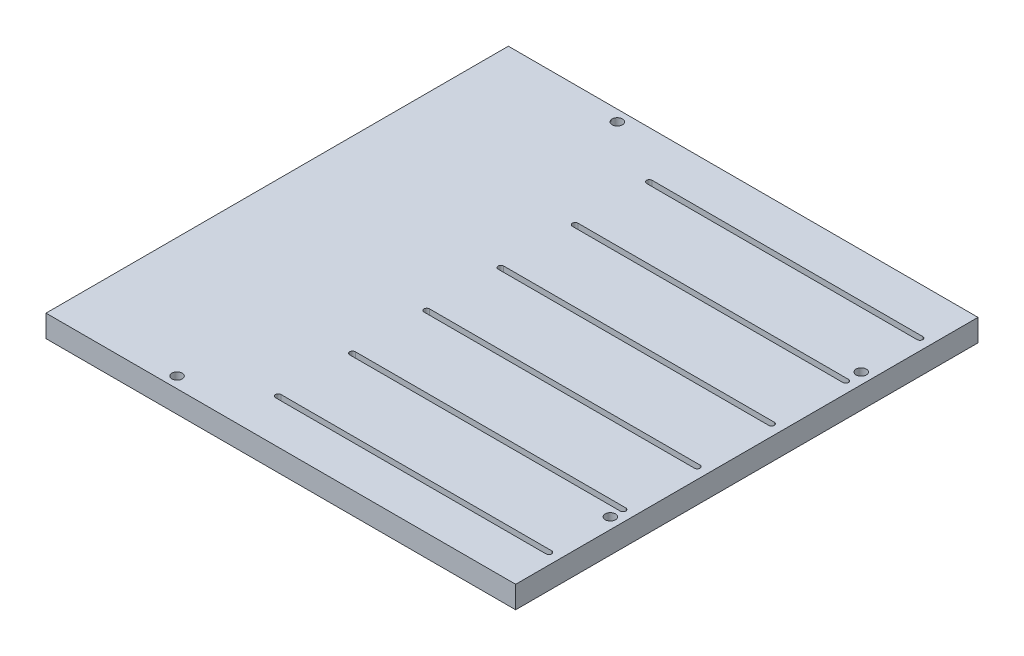
ISO-10303-21;
HEADER;
FILE_DESCRIPTION(('STEP AP214'),'2;1');
FILE_NAME('part.step','',(''),(''),'','','');
FILE_SCHEMA(('AUTOMOTIVE_DESIGN { 1 0 10303 214 1 1 1 1 }'));
ENDSEC;
DATA;
#1=APPLICATION_CONTEXT('core data for automotive mechanical design processes');
#2=APPLICATION_PROTOCOL_DEFINITION('international standard','automotive_design',2000,#1);
#3=PRODUCT_CONTEXT('',#1,'mechanical');
#4=PRODUCT('Part','Part','',(#3));
#5=PRODUCT_RELATED_PRODUCT_CATEGORY('part','',(#4));
#6=PRODUCT_DEFINITION_FORMATION('','',#4);
#7=PRODUCT_DEFINITION_CONTEXT('part definition',#1,'design');
#8=PRODUCT_DEFINITION('design','',#6,#7);
#9=PRODUCT_DEFINITION_SHAPE('','',#8);
#10=(LENGTH_UNIT() NAMED_UNIT(*) SI_UNIT(.MILLI.,.METRE.));
#11=(NAMED_UNIT(*) PLANE_ANGLE_UNIT() SI_UNIT($,.RADIAN.));
#12=(NAMED_UNIT(*) SI_UNIT($,.STERADIAN.) SOLID_ANGLE_UNIT());
#13=UNCERTAINTY_MEASURE_WITH_UNIT(LENGTH_MEASURE(1.E-05),#10,'distance_accuracy_value','');
#14=(GEOMETRIC_REPRESENTATION_CONTEXT(3) GLOBAL_UNCERTAINTY_ASSIGNED_CONTEXT((#13)) GLOBAL_UNIT_ASSIGNED_CONTEXT((#10,
#11,#12)) REPRESENTATION_CONTEXT('',''));
#15=CARTESIAN_POINT('',(0.,0.,0.));
#16=DIRECTION('',(0.,0.,1.));
#17=DIRECTION('',(1.,0.,0.));
#18=AXIS2_PLACEMENT_3D('',#15,#16,#17);
#19=CARTESIAN_POINT('',(42.,6.35,66.35));
#20=DIRECTION('',(-1.,0.,0.));
#21=DIRECTION('',(0.,0.,1.));
#22=AXIS2_PLACEMENT_3D('',#19,#20,#21);
#23=PLANE('',#22);
#24=DIRECTION('',(0.,0.,-1.));
#25=VECTOR('',#24,1.);
#26=CARTESIAN_POINT('',(42.,0.,66.35));
#27=LINE('',#26,#25);
#28=CARTESIAN_POINT('',(42.,0.,66.35));
#29=VERTEX_POINT('',#28);
#30=CARTESIAN_POINT('',(42.,0.,-66.35));
#31=VERTEX_POINT('',#30);
#32=EDGE_CURVE('E439',#29,#31,#27,.T.);
#33=ORIENTED_EDGE('',*,*,#32,.T.);
#34=DIRECTION('',(0.,-1.,0.));
#35=VECTOR('',#34,1.);
#36=CARTESIAN_POINT('',(42.,6.35,-66.35));
#37=LINE('',#36,#35);
#38=CARTESIAN_POINT('',(42.,6.35,-66.35));
#39=VERTEX_POINT('',#38);
#40=EDGE_CURVE('E11',#39,#31,#37,.T.);
#41=ORIENTED_EDGE('',*,*,#40,.F.);
#42=DIRECTION('',(0.,0.,-1.));
#43=VECTOR('',#42,1.);
#44=CARTESIAN_POINT('',(42.,6.35,66.35));
#45=LINE('',#44,#43);
#46=CARTESIAN_POINT('',(42.,6.35,66.35));
#47=VERTEX_POINT('',#46);
#48=EDGE_CURVE('E440',#47,#39,#45,.T.);
#49=ORIENTED_EDGE('',*,*,#48,.F.);
#50=DIRECTION('',(0.,-1.,0.));
#51=VECTOR('',#50,1.);
#52=CARTESIAN_POINT('',(42.,6.35,66.35));
#53=LINE('',#52,#51);
#54=EDGE_CURVE('E450',#47,#29,#53,.T.);
#55=ORIENTED_EDGE('',*,*,#54,.T.);
#56=EDGE_LOOP('',(#33,#41,#49,#55));
#57=FACE_BOUND('',#56,.T.);
#58=ADVANCED_FACE('F43',(#57),#23,.F.);
#59=CARTESIAN_POINT('',(-42.,6.35,-66.35));
#60=DIRECTION('',(0.,0.,1.));
#61=DIRECTION('',(1.,0.,0.));
#62=AXIS2_PLACEMENT_3D('',#59,#60,#61);
#63=PLANE('',#62);
#64=DIRECTION('',(-1.,0.,0.));
#65=VECTOR('',#64,1.);
#66=CARTESIAN_POINT('',(-42.,0.,-66.35));
#67=LINE('',#66,#65);
#68=CARTESIAN_POINT('',(-92.8,0.,-66.35));
#69=VERTEX_POINT('',#68);
#70=EDGE_CURVE('E453',#31,#69,#67,.T.);
#71=ORIENTED_EDGE('',*,*,#70,.T.);
#72=DIRECTION('',(0.,-1.,0.));
#73=VECTOR('',#72,1.);
#74=CARTESIAN_POINT('',(-92.8,6.35,-66.35));
#75=LINE('',#74,#73);
#76=CARTESIAN_POINT('',(-92.8,6.35,-66.35));
#77=VERTEX_POINT('',#76);
#78=EDGE_CURVE('E50',#77,#69,#75,.T.);
#79=ORIENTED_EDGE('',*,*,#78,.F.);
#80=DIRECTION('',(-1.,0.,0.));
#81=VECTOR('',#80,1.);
#82=CARTESIAN_POINT('',(-42.,6.35,-66.35));
#83=LINE('',#82,#81);
#84=EDGE_CURVE('E443',#39,#77,#83,.T.);
#85=ORIENTED_EDGE('',*,*,#84,.F.);
#86=ORIENTED_EDGE('',*,*,#40,.T.);
#87=EDGE_LOOP('',(#71,#79,#85,#86));
#88=FACE_BOUND('',#87,.T.);
#89=ADVANCED_FACE('F482',(#88),#63,.F.);
#90=CARTESIAN_POINT('',(-92.8,6.35,-66.35));
#91=DIRECTION('',(1.,0.,0.));
#92=DIRECTION('',(0.,0.,-1.));
#93=AXIS2_PLACEMENT_3D('',#90,#91,#92);
#94=PLANE('',#93);
#95=DIRECTION('',(0.,0.,1.));
#96=VECTOR('',#95,1.);
#97=CARTESIAN_POINT('',(-92.8,0.,-66.35));
#98=LINE('',#97,#96);
#99=CARTESIAN_POINT('',(-92.8,0.,66.35));
#100=VERTEX_POINT('',#99);
#101=EDGE_CURVE('E455',#69,#100,#98,.T.);
#102=ORIENTED_EDGE('',*,*,#101,.T.);
#103=DIRECTION('',(0.,-1.,0.));
#104=VECTOR('',#103,1.);
#105=CARTESIAN_POINT('',(-92.8,6.35,66.35));
#106=LINE('',#105,#104);
#107=CARTESIAN_POINT('',(-92.8,6.35,66.35));
#108=VERTEX_POINT('',#107);
#109=EDGE_CURVE('E461',#108,#100,#106,.T.);
#110=ORIENTED_EDGE('',*,*,#109,.F.);
#111=DIRECTION('',(0.,0.,1.));
#112=VECTOR('',#111,1.);
#113=CARTESIAN_POINT('',(-92.8,6.35,-66.35));
#114=LINE('',#113,#112);
#115=EDGE_CURVE('E446',#77,#108,#114,.T.);
#116=ORIENTED_EDGE('',*,*,#115,.F.);
#117=ORIENTED_EDGE('',*,*,#78,.T.);
#118=EDGE_LOOP('',(#102,#110,#116,#117));
#119=FACE_BOUND('',#118,.T.);
#120=ADVANCED_FACE('F468',(#119),#94,.F.);
#121=CARTESIAN_POINT('',(-42.,6.35,66.35));
#122=DIRECTION('',(0.,0.,-1.));
#123=DIRECTION('',(-1.,0.,0.));
#124=AXIS2_PLACEMENT_3D('',#121,#122,#123);
#125=PLANE('',#124);
#126=DIRECTION('',(1.,0.,0.));
#127=VECTOR('',#126,1.);
#128=CARTESIAN_POINT('',(-42.,0.,66.35));
#129=LINE('',#128,#127);
#130=EDGE_CURVE('E444',#100,#29,#129,.T.);
#131=ORIENTED_EDGE('',*,*,#130,.T.);
#132=ORIENTED_EDGE('',*,*,#54,.F.);
#133=DIRECTION('',(1.,0.,0.));
#134=VECTOR('',#133,1.);
#135=CARTESIAN_POINT('',(-42.,6.35,66.35));
#136=LINE('',#135,#134);
#137=EDGE_CURVE('E448',#108,#47,#136,.T.);
#138=ORIENTED_EDGE('',*,*,#137,.F.);
#139=ORIENTED_EDGE('',*,*,#109,.T.);
#140=EDGE_LOOP('',(#131,#132,#138,#139));
#141=FACE_BOUND('',#140,.T.);
#142=ADVANCED_FACE('F475',(#141),#125,.F.);
#143=CARTESIAN_POINT('',(0.,6.35,0.));
#144=DIRECTION('',(0.,-1.,0.));
#145=DIRECTION('',(0.,0.,-1.));
#146=AXIS2_PLACEMENT_3D('',#143,#144,#145);
#147=PLANE('',#146);
#148=CARTESIAN_POINT('',(-58.3499999999982,6.35,-63.178000008999));
#149=DIRECTION('',(0.,1.,0.));
#150=DIRECTION('',(0.,0.,1.));
#151=AXIS2_PLACEMENT_3D('',#148,#149,#150);
#152=CIRCLE('',#151,1.47319999999999);
#153=CARTESIAN_POINT('',(-58.3499999999982,6.35,-61.704800008999));
#154=VERTEX_POINT('',#153);
#155=EDGE_CURVE('E612',#154,#154,#152,.T.);
#156=ORIENTED_EDGE('',*,*,#155,.F.);
#157=EDGE_LOOP('',(#156));
#158=FACE_BOUND('',#157,.T.);
#159=CARTESIAN_POINT('',(-58.3499999999978,6.35,63.171999991001));
#160=DIRECTION('',(0.,1.,0.));
#161=DIRECTION('',(0.,0.,1.));
#162=AXIS2_PLACEMENT_3D('',#159,#160,#161);
#163=CIRCLE('',#162,1.47319999999999);
#164=CARTESIAN_POINT('',(-58.3499999999978,6.35,64.645199991001));
#165=VERTEX_POINT('',#164);
#166=EDGE_CURVE('E614',#165,#165,#163,.T.);
#167=ORIENTED_EDGE('',*,*,#166,.F.);
#168=EDGE_LOOP('',(#167));
#169=FACE_BOUND('',#168,.T.);
#170=DIRECTION('',(1.,0.,0.));
#171=VECTOR('',#170,1.);
#172=CARTESIAN_POINT('',(-38.825,6.35,54.44375));
#173=LINE('',#172,#171);
#174=CARTESIAN_POINT('',(-38.825,6.35,54.44375));
#175=VERTEX_POINT('',#174);
#176=CARTESIAN_POINT('',(38.825,6.35,54.44375));
#177=VERTEX_POINT('',#176);
#178=EDGE_CURVE('E260',#175,#177,#173,.T.);
#179=ORIENTED_EDGE('',*,*,#178,.F.);
#180=CARTESIAN_POINT('',(-38.825,6.35,53.65));
#181=DIRECTION('',(0.,1.,0.));
#182=DIRECTION('',(0.,0.,1.));
#183=AXIS2_PLACEMENT_3D('',#180,#181,#182);
#184=CIRCLE('',#183,0.793750000000006);
#185=CARTESIAN_POINT('',(-38.825,6.35,52.85625));
#186=VERTEX_POINT('',#185);
#187=EDGE_CURVE('E57',#186,#175,#184,.T.);
#188=ORIENTED_EDGE('',*,*,#187,.F.);
#189=DIRECTION('',(-1.,0.,0.));
#190=VECTOR('',#189,1.);
#191=CARTESIAN_POINT('',(-38.825,6.35,52.85625));
#192=LINE('',#191,#190);
#193=CARTESIAN_POINT('',(38.825,6.35,52.85625));
#194=VERTEX_POINT('',#193);
#195=EDGE_CURVE('E248',#194,#186,#192,.T.);
#196=ORIENTED_EDGE('',*,*,#195,.F.);
#197=CARTESIAN_POINT('',(38.825,6.35,53.65));
#198=DIRECTION('',(0.,1.,0.));
#199=DIRECTION('',(0.,0.,1.));
#200=AXIS2_PLACEMENT_3D('',#197,#198,#199);
#201=CIRCLE('',#200,0.79375000000001);
#202=EDGE_CURVE('E251',#177,#194,#201,.T.);
#203=ORIENTED_EDGE('',*,*,#202,.F.);
#204=EDGE_LOOP('',(#179,#188,#196,#203));
#205=FACE_BOUND('',#204,.T.);
#206=DIRECTION('',(1.,0.,0.));
#207=VECTOR('',#206,1.);
#208=CARTESIAN_POINT('',(-38.825,6.35,33.1425));
#209=LINE('',#208,#207);
#210=CARTESIAN_POINT('',(-38.825,6.35,33.1425));
#211=VERTEX_POINT('',#210);
#212=CARTESIAN_POINT('',(38.825,6.35,33.1425));
#213=VERTEX_POINT('',#212);
#214=EDGE_CURVE('E287',#211,#213,#209,.T.);
#215=ORIENTED_EDGE('',*,*,#214,.F.);
#216=CARTESIAN_POINT('',(-38.825,6.35,32.34875));
#217=DIRECTION('',(0.,1.,0.));
#218=DIRECTION('',(0.,0.,1.));
#219=AXIS2_PLACEMENT_3D('',#216,#217,#218);
#220=CIRCLE('',#219,0.79375000000001);
#221=CARTESIAN_POINT('',(-38.825,6.35,31.555));
#222=VERTEX_POINT('',#221);
#223=EDGE_CURVE('E65',#222,#211,#220,.T.);
#224=ORIENTED_EDGE('',*,*,#223,.F.);
#225=DIRECTION('',(-1.,0.,0.));
#226=VECTOR('',#225,1.);
#227=CARTESIAN_POINT('',(-38.825,6.35,31.555));
#228=LINE('',#227,#226);
#229=CARTESIAN_POINT('',(38.825,6.35,31.555));
#230=VERTEX_POINT('',#229);
#231=EDGE_CURVE('E280',#230,#222,#228,.T.);
#232=ORIENTED_EDGE('',*,*,#231,.F.);
#233=CARTESIAN_POINT('',(38.825,6.35,32.34875));
#234=DIRECTION('',(0.,1.,0.));
#235=DIRECTION('',(0.,0.,1.));
#236=AXIS2_PLACEMENT_3D('',#233,#234,#235);
#237=CIRCLE('',#236,0.79375000000001);
#238=EDGE_CURVE('E283',#213,#230,#237,.T.);
#239=ORIENTED_EDGE('',*,*,#238,.F.);
#240=EDGE_LOOP('',(#215,#224,#232,#239));
#241=FACE_BOUND('',#240,.T.);
#242=DIRECTION('',(1.,0.,0.));
#243=VECTOR('',#242,1.);
#244=CARTESIAN_POINT('',(-38.825,6.35,11.84125));
#245=LINE('',#244,#243);
#246=CARTESIAN_POINT('',(-38.825,6.35,11.84125));
#247=VERTEX_POINT('',#246);
#248=CARTESIAN_POINT('',(38.825,6.35,11.84125));
#249=VERTEX_POINT('',#248);
#250=EDGE_CURVE('E319',#247,#249,#245,.T.);
#251=ORIENTED_EDGE('',*,*,#250,.F.);
#252=CARTESIAN_POINT('',(-38.825,6.35,11.0475));
#253=DIRECTION('',(0.,1.,0.));
#254=DIRECTION('',(0.,0.,1.));
#255=AXIS2_PLACEMENT_3D('',#252,#253,#254);
#256=CIRCLE('',#255,0.793749999999996);
#257=CARTESIAN_POINT('',(-38.825,6.35,10.25375));
#258=VERTEX_POINT('',#257);
#259=EDGE_CURVE('E279',#258,#247,#256,.T.);
#260=ORIENTED_EDGE('',*,*,#259,.F.);
#261=DIRECTION('',(-1.,0.,0.));
#262=VECTOR('',#261,1.);
#263=CARTESIAN_POINT('',(-38.825,6.35,10.25375));
#264=LINE('',#263,#262);
#265=CARTESIAN_POINT('',(38.825,6.35,10.25375));
#266=VERTEX_POINT('',#265);
#267=EDGE_CURVE('E312',#266,#258,#264,.T.);
#268=ORIENTED_EDGE('',*,*,#267,.F.);
#269=CARTESIAN_POINT('',(38.825,6.35,11.0475));
#270=DIRECTION('',(0.,1.,0.));
#271=DIRECTION('',(0.,0.,1.));
#272=AXIS2_PLACEMENT_3D('',#269,#270,#271);
#273=CIRCLE('',#272,0.793749999999996);
#274=EDGE_CURVE('E315',#249,#266,#273,.T.);
#275=ORIENTED_EDGE('',*,*,#274,.F.);
#276=EDGE_LOOP('',(#251,#260,#268,#275));
#277=FACE_BOUND('',#276,.T.);
#278=DIRECTION('',(1.,0.,0.));
#279=VECTOR('',#278,1.);
#280=CARTESIAN_POINT('',(-38.825,6.35,-9.46000000000002));
#281=LINE('',#280,#279);
#282=CARTESIAN_POINT('',(-38.825,6.35,-9.46000000000002));
#283=VERTEX_POINT('',#282);
#284=CARTESIAN_POINT('',(38.825,6.35,-9.46000000000002));
#285=VERTEX_POINT('',#284);
#286=EDGE_CURVE('E351',#283,#285,#281,.T.);
#287=ORIENTED_EDGE('',*,*,#286,.F.);
#288=CARTESIAN_POINT('',(-38.825,6.35,-10.25375));
#289=DIRECTION('',(0.,1.,0.));
#290=DIRECTION('',(0.,0.,1.));
#291=AXIS2_PLACEMENT_3D('',#288,#289,#290);
#292=CIRCLE('',#291,0.793749999999996);
#293=CARTESIAN_POINT('',(-38.825,6.35,-11.0475));
#294=VERTEX_POINT('',#293);
#295=EDGE_CURVE('E311',#294,#283,#292,.T.);
#296=ORIENTED_EDGE('',*,*,#295,.F.);
#297=DIRECTION('',(-1.,0.,0.));
#298=VECTOR('',#297,1.);
#299=CARTESIAN_POINT('',(-38.825,6.35,-11.0475));
#300=LINE('',#299,#298);
#301=CARTESIAN_POINT('',(38.825,6.35,-11.0475));
#302=VERTEX_POINT('',#301);
#303=EDGE_CURVE('E344',#302,#294,#300,.T.);
#304=ORIENTED_EDGE('',*,*,#303,.F.);
#305=CARTESIAN_POINT('',(38.825,6.35,-10.25375));
#306=DIRECTION('',(0.,1.,0.));
#307=DIRECTION('',(0.,0.,1.));
#308=AXIS2_PLACEMENT_3D('',#305,#306,#307);
#309=CIRCLE('',#308,0.793749999999996);
#310=EDGE_CURVE('E347',#285,#302,#309,.T.);
#311=ORIENTED_EDGE('',*,*,#310,.F.);
#312=EDGE_LOOP('',(#287,#296,#304,#311));
#313=FACE_BOUND('',#312,.T.);
#314=DIRECTION('',(1.,0.,0.));
#315=VECTOR('',#314,1.);
#316=CARTESIAN_POINT('',(-38.825,6.35,-30.76125));
#317=LINE('',#316,#315);
#318=CARTESIAN_POINT('',(-38.825,6.35,-30.76125));
#319=VERTEX_POINT('',#318);
#320=CARTESIAN_POINT('',(38.825,6.35,-30.76125));
#321=VERTEX_POINT('',#320);
#322=EDGE_CURVE('E383',#319,#321,#317,.T.);
#323=ORIENTED_EDGE('',*,*,#322,.F.);
#324=CARTESIAN_POINT('',(-38.825,6.35,-31.555));
#325=DIRECTION('',(0.,1.,0.));
#326=DIRECTION('',(0.,0.,1.));
#327=AXIS2_PLACEMENT_3D('',#324,#325,#326);
#328=CIRCLE('',#327,0.793750000000003);
#329=CARTESIAN_POINT('',(-38.825,6.35,-32.34875));
#330=VERTEX_POINT('',#329);
#331=EDGE_CURVE('E343',#330,#319,#328,.T.);
#332=ORIENTED_EDGE('',*,*,#331,.F.);
#333=DIRECTION('',(-1.,0.,0.));
#334=VECTOR('',#333,1.);
#335=CARTESIAN_POINT('',(-38.825,6.35,-32.34875));
#336=LINE('',#335,#334);
#337=CARTESIAN_POINT('',(38.825,6.35,-32.34875));
#338=VERTEX_POINT('',#337);
#339=EDGE_CURVE('E376',#338,#330,#336,.T.);
#340=ORIENTED_EDGE('',*,*,#339,.F.);
#341=CARTESIAN_POINT('',(38.825,6.35,-31.555));
#342=DIRECTION('',(0.,1.,0.));
#343=DIRECTION('',(0.,0.,1.));
#344=AXIS2_PLACEMENT_3D('',#341,#342,#343);
#345=CIRCLE('',#344,0.793750000000003);
#346=EDGE_CURVE('E379',#321,#338,#345,.T.);
#347=ORIENTED_EDGE('',*,*,#346,.F.);
#348=EDGE_LOOP('',(#323,#332,#340,#347));
#349=FACE_BOUND('',#348,.T.);
#350=DIRECTION('',(1.,0.,0.));
#351=VECTOR('',#350,1.);
#352=CARTESIAN_POINT('',(-38.825,6.35,-52.0625));
#353=LINE('',#352,#351);
#354=CARTESIAN_POINT('',(-38.825,6.35,-52.0625));
#355=VERTEX_POINT('',#354);
#356=CARTESIAN_POINT('',(38.825,6.35,-52.0625));
#357=VERTEX_POINT('',#356);
#358=EDGE_CURVE('E414',#355,#357,#353,.T.);
#359=ORIENTED_EDGE('',*,*,#358,.F.);
#360=CARTESIAN_POINT('',(-38.825,6.35,-52.85625));
#361=DIRECTION('',(0.,1.,0.));
#362=DIRECTION('',(0.,0.,1.));
#363=AXIS2_PLACEMENT_3D('',#360,#361,#362);
#364=CIRCLE('',#363,0.793749999999996);
#365=CARTESIAN_POINT('',(-38.825,6.35,-53.65));
#366=VERTEX_POINT('',#365);
#367=EDGE_CURVE('E375',#366,#355,#364,.T.);
#368=ORIENTED_EDGE('',*,*,#367,.F.);
#369=DIRECTION('',(-1.,0.,0.));
#370=VECTOR('',#369,1.);
#371=CARTESIAN_POINT('',(-38.825,6.35,-53.65));
#372=LINE('',#371,#370);
#373=CARTESIAN_POINT('',(38.825,6.35,-53.65));
#374=VERTEX_POINT('',#373);
#375=EDGE_CURVE('E407',#374,#366,#372,.T.);
#376=ORIENTED_EDGE('',*,*,#375,.F.);
#377=CARTESIAN_POINT('',(38.825,6.35,-52.85625));
#378=DIRECTION('',(0.,1.,0.));
#379=DIRECTION('',(0.,0.,1.));
#380=AXIS2_PLACEMENT_3D('',#377,#378,#379);
#381=CIRCLE('',#380,0.793749999999996);
#382=EDGE_CURVE('E410',#357,#374,#381,.T.);
#383=ORIENTED_EDGE('',*,*,#382,.F.);
#384=EDGE_LOOP('',(#359,#368,#376,#383));
#385=FACE_BOUND('',#384,.T.);
#386=CARTESIAN_POINT('',(38.825,6.35,-35.997));
#387=DIRECTION('',(0.,1.,0.));
#388=DIRECTION('',(0.,0.,1.));
#389=AXIS2_PLACEMENT_3D('',#386,#387,#388);
#390=CIRCLE('',#389,1.4732);
#391=CARTESIAN_POINT('',(38.825,6.35,-34.5238));
#392=VERTEX_POINT('',#391);
#393=EDGE_CURVE('E266',#392,#392,#390,.T.);
#394=ORIENTED_EDGE('',*,*,#393,.F.);
#395=EDGE_LOOP('',(#394));
#396=FACE_BOUND('',#395,.T.);
#397=CARTESIAN_POINT('',(38.825,6.35,35.997));
#398=DIRECTION('',(0.,1.,0.));
#399=DIRECTION('',(0.,0.,1.));
#400=AXIS2_PLACEMENT_3D('',#397,#398,#399);
#401=CIRCLE('',#400,1.4732);
#402=CARTESIAN_POINT('',(38.825,6.35,37.4702));
#403=VERTEX_POINT('',#402);
#404=EDGE_CURVE('E433',#403,#403,#401,.T.);
#405=ORIENTED_EDGE('',*,*,#404,.F.);
#406=EDGE_LOOP('',(#405));
#407=FACE_BOUND('',#406,.T.);
#408=ORIENTED_EDGE('',*,*,#48,.T.);
#409=ORIENTED_EDGE('',*,*,#84,.T.);
#410=ORIENTED_EDGE('',*,*,#115,.T.);
#411=ORIENTED_EDGE('',*,*,#137,.T.);
#412=EDGE_LOOP('',(#408,#409,#410,#411));
#413=FACE_BOUND('',#412,.T.);
#414=ADVANCED_FACE('F481',(#158,#169,#205,#241,#277,#313,#349,#385,#396,#407,#413),#147,.F.);
#415=CARTESIAN_POINT('',(0.,0.,0.));
#416=DIRECTION('',(0.,-1.,0.));
#417=DIRECTION('',(0.,0.,-1.));
#418=AXIS2_PLACEMENT_3D('',#415,#416,#417);
#419=PLANE('',#418);
#420=CARTESIAN_POINT('',(-58.3499999999982,0.,-63.178000008999));
#421=DIRECTION('',(0.,1.,0.));
#422=DIRECTION('',(0.,0.,1.));
#423=AXIS2_PLACEMENT_3D('',#420,#421,#422);
#424=CIRCLE('',#423,1.47319999999999);
#425=CARTESIAN_POINT('',(-58.3499999999982,0.,-61.704800008999));
#426=VERTEX_POINT('',#425);
#427=EDGE_CURVE('E609',#426,#426,#424,.T.);
#428=ORIENTED_EDGE('',*,*,#427,.T.);
#429=EDGE_LOOP('',(#428));
#430=FACE_BOUND('',#429,.T.);
#431=CARTESIAN_POINT('',(-58.3499999999978,0.,63.171999991001));
#432=DIRECTION('',(0.,1.,0.));
#433=DIRECTION('',(0.,0.,1.));
#434=AXIS2_PLACEMENT_3D('',#431,#432,#433);
#435=CIRCLE('',#434,1.47319999999999);
#436=CARTESIAN_POINT('',(-58.3499999999978,0.,64.645199991001));
#437=VERTEX_POINT('',#436);
#438=EDGE_CURVE('E254',#437,#437,#435,.T.);
#439=ORIENTED_EDGE('',*,*,#438,.T.);
#440=EDGE_LOOP('',(#439));
#441=FACE_BOUND('',#440,.T.);
#442=CARTESIAN_POINT('',(-38.825,0.,53.65));
#443=DIRECTION('',(0.,1.,0.));
#444=DIRECTION('',(0.,0.,1.));
#445=AXIS2_PLACEMENT_3D('',#442,#443,#444);
#446=CIRCLE('',#445,0.793750000000006);
#447=CARTESIAN_POINT('',(-38.825,0.,52.85625));
#448=VERTEX_POINT('',#447);
#449=CARTESIAN_POINT('',(-38.825,0.,54.44375));
#450=VERTEX_POINT('',#449);
#451=EDGE_CURVE('E229',#448,#450,#446,.T.);
#452=ORIENTED_EDGE('',*,*,#451,.T.);
#453=DIRECTION('',(1.,0.,0.));
#454=VECTOR('',#453,1.);
#455=CARTESIAN_POINT('',(-38.825,0.,54.44375));
#456=LINE('',#455,#454);
#457=CARTESIAN_POINT('',(38.825,0.,54.44375));
#458=VERTEX_POINT('',#457);
#459=EDGE_CURVE('E239',#450,#458,#456,.T.);
#460=ORIENTED_EDGE('',*,*,#459,.T.);
#461=CARTESIAN_POINT('',(38.825,0.,53.65));
#462=DIRECTION('',(0.,1.,0.));
#463=DIRECTION('',(0.,0.,1.));
#464=AXIS2_PLACEMENT_3D('',#461,#462,#463);
#465=CIRCLE('',#464,0.79375000000001);
#466=CARTESIAN_POINT('',(38.825,0.,52.85625));
#467=VERTEX_POINT('',#466);
#468=EDGE_CURVE('E243',#458,#467,#465,.T.);
#469=ORIENTED_EDGE('',*,*,#468,.T.);
#470=DIRECTION('',(-1.,0.,0.));
#471=VECTOR('',#470,1.);
#472=CARTESIAN_POINT('',(-38.825,0.,52.85625));
#473=LINE('',#472,#471);
#474=EDGE_CURVE('E235',#467,#448,#473,.T.);
#475=ORIENTED_EDGE('',*,*,#474,.T.);
#476=EDGE_LOOP('',(#452,#460,#469,#475));
#477=FACE_BOUND('',#476,.T.);
#478=CARTESIAN_POINT('',(-38.825,0.,32.34875));
#479=DIRECTION('',(0.,1.,0.));
#480=DIRECTION('',(0.,0.,1.));
#481=AXIS2_PLACEMENT_3D('',#478,#479,#480);
#482=CIRCLE('',#481,0.79375000000001);
#483=CARTESIAN_POINT('',(-38.825,0.,31.555));
#484=VERTEX_POINT('',#483);
#485=CARTESIAN_POINT('',(-38.825,0.,33.1425));
#486=VERTEX_POINT('',#485);
#487=EDGE_CURVE('E284',#484,#486,#482,.T.);
#488=ORIENTED_EDGE('',*,*,#487,.T.);
#489=DIRECTION('',(1.,0.,0.));
#490=VECTOR('',#489,1.);
#491=CARTESIAN_POINT('',(-38.825,0.,33.1425));
#492=LINE('',#491,#490);
#493=CARTESIAN_POINT('',(38.825,0.,33.1425));
#494=VERTEX_POINT('',#493);
#495=EDGE_CURVE('E296',#486,#494,#492,.T.);
#496=ORIENTED_EDGE('',*,*,#495,.T.);
#497=CARTESIAN_POINT('',(38.825,0.,32.34875));
#498=DIRECTION('',(0.,1.,0.));
#499=DIRECTION('',(0.,0.,1.));
#500=AXIS2_PLACEMENT_3D('',#497,#498,#499);
#501=CIRCLE('',#500,0.79375000000001);
#502=CARTESIAN_POINT('',(38.825,0.,31.555));
#503=VERTEX_POINT('',#502);
#504=EDGE_CURVE('E293',#494,#503,#501,.T.);
#505=ORIENTED_EDGE('',*,*,#504,.T.);
#506=DIRECTION('',(-1.,0.,0.));
#507=VECTOR('',#506,1.);
#508=CARTESIAN_POINT('',(-38.825,0.,31.555));
#509=LINE('',#508,#507);
#510=EDGE_CURVE('E272',#503,#484,#509,.T.);
#511=ORIENTED_EDGE('',*,*,#510,.T.);
#512=EDGE_LOOP('',(#488,#496,#505,#511));
#513=FACE_BOUND('',#512,.T.);
#514=CARTESIAN_POINT('',(-38.825,0.,11.0475));
#515=DIRECTION('',(0.,1.,0.));
#516=DIRECTION('',(0.,0.,1.));
#517=AXIS2_PLACEMENT_3D('',#514,#515,#516);
#518=CIRCLE('',#517,0.793749999999996);
#519=CARTESIAN_POINT('',(-38.825,0.,10.25375));
#520=VERTEX_POINT('',#519);
#521=CARTESIAN_POINT('',(-38.825,0.,11.84125));
#522=VERTEX_POINT('',#521);
#523=EDGE_CURVE('E316',#520,#522,#518,.T.);
#524=ORIENTED_EDGE('',*,*,#523,.T.);
#525=DIRECTION('',(1.,0.,0.));
#526=VECTOR('',#525,1.);
#527=CARTESIAN_POINT('',(-38.825,0.,11.84125));
#528=LINE('',#527,#526);
#529=CARTESIAN_POINT('',(38.825,0.,11.84125));
#530=VERTEX_POINT('',#529);
#531=EDGE_CURVE('E328',#522,#530,#528,.T.);
#532=ORIENTED_EDGE('',*,*,#531,.T.);
#533=CARTESIAN_POINT('',(38.825,0.,11.0475));
#534=DIRECTION('',(0.,1.,0.));
#535=DIRECTION('',(0.,0.,1.));
#536=AXIS2_PLACEMENT_3D('',#533,#534,#535);
#537=CIRCLE('',#536,0.793749999999996);
#538=CARTESIAN_POINT('',(38.825,0.,10.25375));
#539=VERTEX_POINT('',#538);
#540=EDGE_CURVE('E325',#530,#539,#537,.T.);
#541=ORIENTED_EDGE('',*,*,#540,.T.);
#542=DIRECTION('',(-1.,0.,0.));
#543=VECTOR('',#542,1.);
#544=CARTESIAN_POINT('',(-38.825,0.,10.25375));
#545=LINE('',#544,#543);
#546=EDGE_CURVE('E304',#539,#520,#545,.T.);
#547=ORIENTED_EDGE('',*,*,#546,.T.);
#548=EDGE_LOOP('',(#524,#532,#541,#547));
#549=FACE_BOUND('',#548,.T.);
#550=CARTESIAN_POINT('',(-38.825,0.,-10.25375));
#551=DIRECTION('',(0.,1.,0.));
#552=DIRECTION('',(0.,0.,1.));
#553=AXIS2_PLACEMENT_3D('',#550,#551,#552);
#554=CIRCLE('',#553,0.793749999999996);
#555=CARTESIAN_POINT('',(-38.825,0.,-11.0475));
#556=VERTEX_POINT('',#555);
#557=CARTESIAN_POINT('',(-38.825,0.,-9.46000000000002));
#558=VERTEX_POINT('',#557);
#559=EDGE_CURVE('E348',#556,#558,#554,.T.);
#560=ORIENTED_EDGE('',*,*,#559,.T.);
#561=DIRECTION('',(1.,0.,0.));
#562=VECTOR('',#561,1.);
#563=CARTESIAN_POINT('',(-38.825,0.,-9.46000000000002));
#564=LINE('',#563,#562);
#565=CARTESIAN_POINT('',(38.825,0.,-9.46000000000002));
#566=VERTEX_POINT('',#565);
#567=EDGE_CURVE('E360',#558,#566,#564,.T.);
#568=ORIENTED_EDGE('',*,*,#567,.T.);
#569=CARTESIAN_POINT('',(38.825,0.,-10.25375));
#570=DIRECTION('',(0.,1.,0.));
#571=DIRECTION('',(0.,0.,1.));
#572=AXIS2_PLACEMENT_3D('',#569,#570,#571);
#573=CIRCLE('',#572,0.793749999999996);
#574=CARTESIAN_POINT('',(38.825,0.,-11.0475));
#575=VERTEX_POINT('',#574);
#576=EDGE_CURVE('E357',#566,#575,#573,.T.);
#577=ORIENTED_EDGE('',*,*,#576,.T.);
#578=DIRECTION('',(-1.,0.,0.));
#579=VECTOR('',#578,1.);
#580=CARTESIAN_POINT('',(-38.825,0.,-11.0475));
#581=LINE('',#580,#579);
#582=EDGE_CURVE('E336',#575,#556,#581,.T.);
#583=ORIENTED_EDGE('',*,*,#582,.T.);
#584=EDGE_LOOP('',(#560,#568,#577,#583));
#585=FACE_BOUND('',#584,.T.);
#586=CARTESIAN_POINT('',(-38.825,0.,-31.555));
#587=DIRECTION('',(0.,1.,0.));
#588=DIRECTION('',(0.,0.,1.));
#589=AXIS2_PLACEMENT_3D('',#586,#587,#588);
#590=CIRCLE('',#589,0.793750000000003);
#591=CARTESIAN_POINT('',(-38.825,0.,-32.34875));
#592=VERTEX_POINT('',#591);
#593=CARTESIAN_POINT('',(-38.825,0.,-30.76125));
#594=VERTEX_POINT('',#593);
#595=EDGE_CURVE('E380',#592,#594,#590,.T.);
#596=ORIENTED_EDGE('',*,*,#595,.T.);
#597=DIRECTION('',(1.,0.,0.));
#598=VECTOR('',#597,1.);
#599=CARTESIAN_POINT('',(-38.825,0.,-30.76125));
#600=LINE('',#599,#598);
#601=CARTESIAN_POINT('',(38.825,0.,-30.76125));
#602=VERTEX_POINT('',#601);
#603=EDGE_CURVE('E392',#594,#602,#600,.T.);
#604=ORIENTED_EDGE('',*,*,#603,.T.);
#605=CARTESIAN_POINT('',(38.825,0.,-31.555));
#606=DIRECTION('',(0.,1.,0.));
#607=DIRECTION('',(0.,0.,1.));
#608=AXIS2_PLACEMENT_3D('',#605,#606,#607);
#609=CIRCLE('',#608,0.793750000000003);
#610=CARTESIAN_POINT('',(38.825,0.,-32.34875));
#611=VERTEX_POINT('',#610);
#612=EDGE_CURVE('E389',#602,#611,#609,.T.);
#613=ORIENTED_EDGE('',*,*,#612,.T.);
#614=DIRECTION('',(-1.,0.,0.));
#615=VECTOR('',#614,1.);
#616=CARTESIAN_POINT('',(-38.825,0.,-32.34875));
#617=LINE('',#616,#615);
#618=EDGE_CURVE('E368',#611,#592,#617,.T.);
#619=ORIENTED_EDGE('',*,*,#618,.T.);
#620=EDGE_LOOP('',(#596,#604,#613,#619));
#621=FACE_BOUND('',#620,.T.);
#622=CARTESIAN_POINT('',(-38.825,0.,-52.85625));
#623=DIRECTION('',(0.,1.,0.));
#624=DIRECTION('',(0.,0.,1.));
#625=AXIS2_PLACEMENT_3D('',#622,#623,#624);
#626=CIRCLE('',#625,0.793749999999996);
#627=CARTESIAN_POINT('',(-38.825,0.,-53.65));
#628=VERTEX_POINT('',#627);
#629=CARTESIAN_POINT('',(-38.825,0.,-52.0625));
#630=VERTEX_POINT('',#629);
#631=EDGE_CURVE('E411',#628,#630,#626,.T.);
#632=ORIENTED_EDGE('',*,*,#631,.T.);
#633=DIRECTION('',(1.,0.,0.));
#634=VECTOR('',#633,1.);
#635=CARTESIAN_POINT('',(-38.825,0.,-52.0625));
#636=LINE('',#635,#634);
#637=CARTESIAN_POINT('',(38.825,0.,-52.0625));
#638=VERTEX_POINT('',#637);
#639=EDGE_CURVE('E423',#630,#638,#636,.T.);
#640=ORIENTED_EDGE('',*,*,#639,.T.);
#641=CARTESIAN_POINT('',(38.825,0.,-52.85625));
#642=DIRECTION('',(0.,1.,0.));
#643=DIRECTION('',(0.,0.,1.));
#644=AXIS2_PLACEMENT_3D('',#641,#642,#643);
#645=CIRCLE('',#644,0.793749999999996);
#646=CARTESIAN_POINT('',(38.825,0.,-53.65));
#647=VERTEX_POINT('',#646);
#648=EDGE_CURVE('E420',#638,#647,#645,.T.);
#649=ORIENTED_EDGE('',*,*,#648,.T.);
#650=DIRECTION('',(-1.,0.,0.));
#651=VECTOR('',#650,1.);
#652=CARTESIAN_POINT('',(-38.825,0.,-53.65));
#653=LINE('',#652,#651);
#654=EDGE_CURVE('E400',#647,#628,#653,.T.);
#655=ORIENTED_EDGE('',*,*,#654,.T.);
#656=EDGE_LOOP('',(#632,#640,#649,#655));
#657=FACE_BOUND('',#656,.T.);
#658=CARTESIAN_POINT('',(38.825,0.,-35.997));
#659=DIRECTION('',(0.,1.,0.));
#660=DIRECTION('',(0.,0.,1.));
#661=AXIS2_PLACEMENT_3D('',#658,#659,#660);
#662=CIRCLE('',#661,1.4732);
#663=CARTESIAN_POINT('',(38.825,0.,-34.5238));
#664=VERTEX_POINT('',#663);
#665=EDGE_CURVE('E430',#664,#664,#662,.T.);
#666=ORIENTED_EDGE('',*,*,#665,.T.);
#667=EDGE_LOOP('',(#666));
#668=FACE_BOUND('',#667,.T.);
#669=CARTESIAN_POINT('',(38.825,0.,35.997));
#670=DIRECTION('',(0.,1.,0.));
#671=DIRECTION('',(0.,0.,1.));
#672=AXIS2_PLACEMENT_3D('',#669,#670,#671);
#673=CIRCLE('',#672,1.4732);
#674=CARTESIAN_POINT('',(38.825,0.,37.4702));
#675=VERTEX_POINT('',#674);
#676=EDGE_CURVE('E436',#675,#675,#673,.T.);
#677=ORIENTED_EDGE('',*,*,#676,.T.);
#678=EDGE_LOOP('',(#677));
#679=FACE_BOUND('',#678,.T.);
#680=ORIENTED_EDGE('',*,*,#32,.F.);
#681=ORIENTED_EDGE('',*,*,#130,.F.);
#682=ORIENTED_EDGE('',*,*,#101,.F.);
#683=ORIENTED_EDGE('',*,*,#70,.F.);
#684=EDGE_LOOP('',(#680,#681,#682,#683));
#685=FACE_BOUND('',#684,.T.);
#686=ADVANCED_FACE('F245',(#430,#441,#477,#513,#549,#585,#621,#657,#668,#679,#685),#419,.T.);
#687=CARTESIAN_POINT('',(38.825,6.35,35.997));
#688=DIRECTION('',(0.,1.,0.));
#689=DIRECTION('',(0.,0.,1.));
#690=AXIS2_PLACEMENT_3D('',#687,#688,#689);
#691=CYLINDRICAL_SURFACE('',#690,1.4732);
#692=ORIENTED_EDGE('',*,*,#676,.F.);
#693=EDGE_LOOP('',(#692));
#694=FACE_BOUND('',#693,.T.);
#695=ORIENTED_EDGE('',*,*,#404,.T.);
#696=EDGE_LOOP('',(#695));
#697=FACE_BOUND('',#696,.T.);
#698=ADVANCED_FACE('F494',(#694,#697),#691,.F.);
#699=CARTESIAN_POINT('',(38.825,6.35,-35.997));
#700=DIRECTION('',(0.,1.,0.));
#701=DIRECTION('',(0.,0.,1.));
#702=AXIS2_PLACEMENT_3D('',#699,#700,#701);
#703=CYLINDRICAL_SURFACE('',#702,1.4732);
#704=ORIENTED_EDGE('',*,*,#665,.F.);
#705=EDGE_LOOP('',(#704));
#706=FACE_BOUND('',#705,.T.);
#707=ORIENTED_EDGE('',*,*,#393,.T.);
#708=EDGE_LOOP('',(#707));
#709=FACE_BOUND('',#708,.T.);
#710=ADVANCED_FACE('F501',(#706,#709),#703,.F.);
#711=CARTESIAN_POINT('',(-38.825,0.,-52.85625));
#712=DIRECTION('',(0.,1.,0.));
#713=DIRECTION('',(0.,0.,1.));
#714=AXIS2_PLACEMENT_3D('',#711,#712,#713);
#715=CYLINDRICAL_SURFACE('',#714,0.793749999999996);
#716=ORIENTED_EDGE('',*,*,#367,.T.);
#717=DIRECTION('',(0.,1.,0.));
#718=VECTOR('',#717,1.);
#719=CARTESIAN_POINT('',(-38.825,0.,-52.0625));
#720=LINE('',#719,#718);
#721=EDGE_CURVE('E397',#630,#355,#720,.T.);
#722=ORIENTED_EDGE('',*,*,#721,.F.);
#723=ORIENTED_EDGE('',*,*,#631,.F.);
#724=DIRECTION('',(0.,1.,0.));
#725=VECTOR('',#724,1.);
#726=CARTESIAN_POINT('',(-38.825,0.,-53.65));
#727=LINE('',#726,#725);
#728=EDGE_CURVE('E405',#628,#366,#727,.T.);
#729=ORIENTED_EDGE('',*,*,#728,.T.);
#730=EDGE_LOOP('',(#716,#722,#723,#729));
#731=FACE_BOUND('',#730,.T.);
#732=ADVANCED_FACE('F505',(#731),#715,.F.);
#733=CARTESIAN_POINT('',(-38.825,0.,-53.65));
#734=DIRECTION('',(0.,0.,-1.));
#735=DIRECTION('',(-1.,0.,0.));
#736=AXIS2_PLACEMENT_3D('',#733,#734,#735);
#737=PLANE('',#736);
#738=ORIENTED_EDGE('',*,*,#375,.T.);
#739=ORIENTED_EDGE('',*,*,#728,.F.);
#740=ORIENTED_EDGE('',*,*,#654,.F.);
#741=DIRECTION('',(0.,1.,0.));
#742=VECTOR('',#741,1.);
#743=CARTESIAN_POINT('',(38.825,0.,-53.65));
#744=LINE('',#743,#742);
#745=EDGE_CURVE('E403',#647,#374,#744,.T.);
#746=ORIENTED_EDGE('',*,*,#745,.T.);
#747=EDGE_LOOP('',(#738,#739,#740,#746));
#748=FACE_BOUND('',#747,.T.);
#749=ADVANCED_FACE('F507',(#748),#737,.F.);
#750=CARTESIAN_POINT('',(38.825,0.,-52.85625));
#751=DIRECTION('',(0.,1.,0.));
#752=DIRECTION('',(0.,0.,1.));
#753=AXIS2_PLACEMENT_3D('',#750,#751,#752);
#754=CYLINDRICAL_SURFACE('',#753,0.793749999999996);
#755=ORIENTED_EDGE('',*,*,#382,.T.);
#756=ORIENTED_EDGE('',*,*,#745,.F.);
#757=ORIENTED_EDGE('',*,*,#648,.F.);
#758=DIRECTION('',(0.,1.,0.));
#759=VECTOR('',#758,1.);
#760=CARTESIAN_POINT('',(38.825,0.,-52.0625));
#761=LINE('',#760,#759);
#762=EDGE_CURVE('E401',#638,#357,#761,.T.);
#763=ORIENTED_EDGE('',*,*,#762,.T.);
#764=EDGE_LOOP('',(#755,#756,#757,#763));
#765=FACE_BOUND('',#764,.T.);
#766=ADVANCED_FACE('F510',(#765),#754,.F.);
#767=CARTESIAN_POINT('',(-38.825,0.,-52.0625));
#768=DIRECTION('',(0.,0.,1.));
#769=DIRECTION('',(1.,0.,0.));
#770=AXIS2_PLACEMENT_3D('',#767,#768,#769);
#771=PLANE('',#770);
#772=ORIENTED_EDGE('',*,*,#358,.T.);
#773=ORIENTED_EDGE('',*,*,#762,.F.);
#774=ORIENTED_EDGE('',*,*,#639,.F.);
#775=ORIENTED_EDGE('',*,*,#721,.T.);
#776=EDGE_LOOP('',(#772,#773,#774,#775));
#777=FACE_BOUND('',#776,.T.);
#778=ADVANCED_FACE('F514',(#777),#771,.F.);
#779=CARTESIAN_POINT('',(-38.825,0.,-31.555));
#780=DIRECTION('',(0.,1.,0.));
#781=DIRECTION('',(0.,0.,1.));
#782=AXIS2_PLACEMENT_3D('',#779,#780,#781);
#783=CYLINDRICAL_SURFACE('',#782,0.793750000000003);
#784=ORIENTED_EDGE('',*,*,#331,.T.);
#785=DIRECTION('',(0.,1.,0.));
#786=VECTOR('',#785,1.);
#787=CARTESIAN_POINT('',(-38.825,0.,-30.76125));
#788=LINE('',#787,#786);
#789=EDGE_CURVE('E365',#594,#319,#788,.T.);
#790=ORIENTED_EDGE('',*,*,#789,.F.);
#791=ORIENTED_EDGE('',*,*,#595,.F.);
#792=DIRECTION('',(0.,1.,0.));
#793=VECTOR('',#792,1.);
#794=CARTESIAN_POINT('',(-38.825,0.,-32.34875));
#795=LINE('',#794,#793);
#796=EDGE_CURVE('E373',#592,#330,#795,.T.);
#797=ORIENTED_EDGE('',*,*,#796,.T.);
#798=EDGE_LOOP('',(#784,#790,#791,#797));
#799=FACE_BOUND('',#798,.T.);
#800=ADVANCED_FACE('F518',(#799),#783,.F.);
#801=CARTESIAN_POINT('',(-38.825,0.,-32.34875));
#802=DIRECTION('',(0.,0.,-1.));
#803=DIRECTION('',(-1.,0.,0.));
#804=AXIS2_PLACEMENT_3D('',#801,#802,#803);
#805=PLANE('',#804);
#806=ORIENTED_EDGE('',*,*,#339,.T.);
#807=ORIENTED_EDGE('',*,*,#796,.F.);
#808=ORIENTED_EDGE('',*,*,#618,.F.);
#809=DIRECTION('',(0.,1.,0.));
#810=VECTOR('',#809,1.);
#811=CARTESIAN_POINT('',(38.825,0.,-32.34875));
#812=LINE('',#811,#810);
#813=EDGE_CURVE('E371',#611,#338,#812,.T.);
#814=ORIENTED_EDGE('',*,*,#813,.T.);
#815=EDGE_LOOP('',(#806,#807,#808,#814));
#816=FACE_BOUND('',#815,.T.);
#817=ADVANCED_FACE('F523',(#816),#805,.F.);
#818=CARTESIAN_POINT('',(38.825,0.,-31.555));
#819=DIRECTION('',(0.,1.,0.));
#820=DIRECTION('',(0.,0.,1.));
#821=AXIS2_PLACEMENT_3D('',#818,#819,#820);
#822=CYLINDRICAL_SURFACE('',#821,0.793750000000003);
#823=ORIENTED_EDGE('',*,*,#346,.T.);
#824=ORIENTED_EDGE('',*,*,#813,.F.);
#825=ORIENTED_EDGE('',*,*,#612,.F.);
#826=DIRECTION('',(0.,1.,0.));
#827=VECTOR('',#826,1.);
#828=CARTESIAN_POINT('',(38.825,0.,-30.76125));
#829=LINE('',#828,#827);
#830=EDGE_CURVE('E369',#602,#321,#829,.T.);
#831=ORIENTED_EDGE('',*,*,#830,.T.);
#832=EDGE_LOOP('',(#823,#824,#825,#831));
#833=FACE_BOUND('',#832,.T.);
#834=ADVANCED_FACE('F526',(#833),#822,.F.);
#835=CARTESIAN_POINT('',(-38.825,0.,-30.76125));
#836=DIRECTION('',(0.,0.,1.));
#837=DIRECTION('',(1.,0.,0.));
#838=AXIS2_PLACEMENT_3D('',#835,#836,#837);
#839=PLANE('',#838);
#840=ORIENTED_EDGE('',*,*,#322,.T.);
#841=ORIENTED_EDGE('',*,*,#830,.F.);
#842=ORIENTED_EDGE('',*,*,#603,.F.);
#843=ORIENTED_EDGE('',*,*,#789,.T.);
#844=EDGE_LOOP('',(#840,#841,#842,#843));
#845=FACE_BOUND('',#844,.T.);
#846=ADVANCED_FACE('F530',(#845),#839,.F.);
#847=CARTESIAN_POINT('',(-38.825,0.,-10.25375));
#848=DIRECTION('',(0.,1.,0.));
#849=DIRECTION('',(0.,0.,1.));
#850=AXIS2_PLACEMENT_3D('',#847,#848,#849);
#851=CYLINDRICAL_SURFACE('',#850,0.793749999999996);
#852=ORIENTED_EDGE('',*,*,#295,.T.);
#853=DIRECTION('',(0.,1.,0.));
#854=VECTOR('',#853,1.);
#855=CARTESIAN_POINT('',(-38.825,0.,-9.46000000000002));
#856=LINE('',#855,#854);
#857=EDGE_CURVE('E333',#558,#283,#856,.T.);
#858=ORIENTED_EDGE('',*,*,#857,.F.);
#859=ORIENTED_EDGE('',*,*,#559,.F.);
#860=DIRECTION('',(0.,1.,0.));
#861=VECTOR('',#860,1.);
#862=CARTESIAN_POINT('',(-38.825,0.,-11.0475));
#863=LINE('',#862,#861);
#864=EDGE_CURVE('E341',#556,#294,#863,.T.);
#865=ORIENTED_EDGE('',*,*,#864,.T.);
#866=EDGE_LOOP('',(#852,#858,#859,#865));
#867=FACE_BOUND('',#866,.T.);
#868=ADVANCED_FACE('F534',(#867),#851,.F.);
#869=CARTESIAN_POINT('',(-38.825,0.,-11.0475));
#870=DIRECTION('',(0.,0.,-1.));
#871=DIRECTION('',(-1.,0.,0.));
#872=AXIS2_PLACEMENT_3D('',#869,#870,#871);
#873=PLANE('',#872);
#874=ORIENTED_EDGE('',*,*,#303,.T.);
#875=ORIENTED_EDGE('',*,*,#864,.F.);
#876=ORIENTED_EDGE('',*,*,#582,.F.);
#877=DIRECTION('',(0.,1.,0.));
#878=VECTOR('',#877,1.);
#879=CARTESIAN_POINT('',(38.825,0.,-11.0475));
#880=LINE('',#879,#878);
#881=EDGE_CURVE('E339',#575,#302,#880,.T.);
#882=ORIENTED_EDGE('',*,*,#881,.T.);
#883=EDGE_LOOP('',(#874,#875,#876,#882));
#884=FACE_BOUND('',#883,.T.);
#885=ADVANCED_FACE('F539',(#884),#873,.F.);
#886=CARTESIAN_POINT('',(38.825,0.,-10.25375));
#887=DIRECTION('',(0.,1.,0.));
#888=DIRECTION('',(0.,0.,1.));
#889=AXIS2_PLACEMENT_3D('',#886,#887,#888);
#890=CYLINDRICAL_SURFACE('',#889,0.793749999999996);
#891=ORIENTED_EDGE('',*,*,#310,.T.);
#892=ORIENTED_EDGE('',*,*,#881,.F.);
#893=ORIENTED_EDGE('',*,*,#576,.F.);
#894=DIRECTION('',(0.,1.,0.));
#895=VECTOR('',#894,1.);
#896=CARTESIAN_POINT('',(38.825,0.,-9.46000000000002));
#897=LINE('',#896,#895);
#898=EDGE_CURVE('E337',#566,#285,#897,.T.);
#899=ORIENTED_EDGE('',*,*,#898,.T.);
#900=EDGE_LOOP('',(#891,#892,#893,#899));
#901=FACE_BOUND('',#900,.T.);
#902=ADVANCED_FACE('F542',(#901),#890,.F.);
#903=CARTESIAN_POINT('',(-38.825,0.,-9.46000000000002));
#904=DIRECTION('',(0.,0.,1.));
#905=DIRECTION('',(1.,0.,0.));
#906=AXIS2_PLACEMENT_3D('',#903,#904,#905);
#907=PLANE('',#906);
#908=ORIENTED_EDGE('',*,*,#286,.T.);
#909=ORIENTED_EDGE('',*,*,#898,.F.);
#910=ORIENTED_EDGE('',*,*,#567,.F.);
#911=ORIENTED_EDGE('',*,*,#857,.T.);
#912=EDGE_LOOP('',(#908,#909,#910,#911));
#913=FACE_BOUND('',#912,.T.);
#914=ADVANCED_FACE('F546',(#913),#907,.F.);
#915=CARTESIAN_POINT('',(-38.825,0.,11.0475));
#916=DIRECTION('',(0.,1.,0.));
#917=DIRECTION('',(0.,0.,1.));
#918=AXIS2_PLACEMENT_3D('',#915,#916,#917);
#919=CYLINDRICAL_SURFACE('',#918,0.793749999999996);
#920=ORIENTED_EDGE('',*,*,#259,.T.);
#921=DIRECTION('',(0.,1.,0.));
#922=VECTOR('',#921,1.);
#923=CARTESIAN_POINT('',(-38.825,0.,11.84125));
#924=LINE('',#923,#922);
#925=EDGE_CURVE('E301',#522,#247,#924,.T.);
#926=ORIENTED_EDGE('',*,*,#925,.F.);
#927=ORIENTED_EDGE('',*,*,#523,.F.);
#928=DIRECTION('',(0.,1.,0.));
#929=VECTOR('',#928,1.);
#930=CARTESIAN_POINT('',(-38.825,0.,10.25375));
#931=LINE('',#930,#929);
#932=EDGE_CURVE('E309',#520,#258,#931,.T.);
#933=ORIENTED_EDGE('',*,*,#932,.T.);
#934=EDGE_LOOP('',(#920,#926,#927,#933));
#935=FACE_BOUND('',#934,.T.);
#936=ADVANCED_FACE('F550',(#935),#919,.F.);
#937=CARTESIAN_POINT('',(-38.825,0.,10.25375));
#938=DIRECTION('',(0.,0.,-1.));
#939=DIRECTION('',(-1.,0.,0.));
#940=AXIS2_PLACEMENT_3D('',#937,#938,#939);
#941=PLANE('',#940);
#942=ORIENTED_EDGE('',*,*,#267,.T.);
#943=ORIENTED_EDGE('',*,*,#932,.F.);
#944=ORIENTED_EDGE('',*,*,#546,.F.);
#945=DIRECTION('',(0.,1.,0.));
#946=VECTOR('',#945,1.);
#947=CARTESIAN_POINT('',(38.825,0.,10.25375));
#948=LINE('',#947,#946);
#949=EDGE_CURVE('E307',#539,#266,#948,.T.);
#950=ORIENTED_EDGE('',*,*,#949,.T.);
#951=EDGE_LOOP('',(#942,#943,#944,#950));
#952=FACE_BOUND('',#951,.T.);
#953=ADVANCED_FACE('F555',(#952),#941,.F.);
#954=CARTESIAN_POINT('',(38.825,0.,11.0475));
#955=DIRECTION('',(0.,1.,0.));
#956=DIRECTION('',(0.,0.,1.));
#957=AXIS2_PLACEMENT_3D('',#954,#955,#956);
#958=CYLINDRICAL_SURFACE('',#957,0.793749999999996);
#959=ORIENTED_EDGE('',*,*,#274,.T.);
#960=ORIENTED_EDGE('',*,*,#949,.F.);
#961=ORIENTED_EDGE('',*,*,#540,.F.);
#962=DIRECTION('',(0.,1.,0.));
#963=VECTOR('',#962,1.);
#964=CARTESIAN_POINT('',(38.825,0.,11.84125));
#965=LINE('',#964,#963);
#966=EDGE_CURVE('E305',#530,#249,#965,.T.);
#967=ORIENTED_EDGE('',*,*,#966,.T.);
#968=EDGE_LOOP('',(#959,#960,#961,#967));
#969=FACE_BOUND('',#968,.T.);
#970=ADVANCED_FACE('F558',(#969),#958,.F.);
#971=CARTESIAN_POINT('',(-38.825,0.,11.84125));
#972=DIRECTION('',(0.,0.,1.));
#973=DIRECTION('',(1.,0.,0.));
#974=AXIS2_PLACEMENT_3D('',#971,#972,#973);
#975=PLANE('',#974);
#976=ORIENTED_EDGE('',*,*,#250,.T.);
#977=ORIENTED_EDGE('',*,*,#966,.F.);
#978=ORIENTED_EDGE('',*,*,#531,.F.);
#979=ORIENTED_EDGE('',*,*,#925,.T.);
#980=EDGE_LOOP('',(#976,#977,#978,#979));
#981=FACE_BOUND('',#980,.T.);
#982=ADVANCED_FACE('F562',(#981),#975,.F.);
#983=CARTESIAN_POINT('',(-38.825,0.,32.34875));
#984=DIRECTION('',(0.,1.,0.));
#985=DIRECTION('',(0.,0.,1.));
#986=AXIS2_PLACEMENT_3D('',#983,#984,#985);
#987=CYLINDRICAL_SURFACE('',#986,0.79375000000001);
#988=ORIENTED_EDGE('',*,*,#223,.T.);
#989=DIRECTION('',(0.,1.,0.));
#990=VECTOR('',#989,1.);
#991=CARTESIAN_POINT('',(-38.825,0.,33.1425));
#992=LINE('',#991,#990);
#993=EDGE_CURVE('E270',#486,#211,#992,.T.);
#994=ORIENTED_EDGE('',*,*,#993,.F.);
#995=ORIENTED_EDGE('',*,*,#487,.F.);
#996=DIRECTION('',(0.,1.,0.));
#997=VECTOR('',#996,1.);
#998=CARTESIAN_POINT('',(-38.825,0.,31.555));
#999=LINE('',#998,#997);
#1000=EDGE_CURVE('E277',#484,#222,#999,.T.);
#1001=ORIENTED_EDGE('',*,*,#1000,.T.);
#1002=EDGE_LOOP('',(#988,#994,#995,#1001));
#1003=FACE_BOUND('',#1002,.T.);
#1004=ADVANCED_FACE('F566',(#1003),#987,.F.);
#1005=CARTESIAN_POINT('',(-38.825,0.,31.555));
#1006=DIRECTION('',(0.,0.,-1.));
#1007=DIRECTION('',(-1.,0.,0.));
#1008=AXIS2_PLACEMENT_3D('',#1005,#1006,#1007);
#1009=PLANE('',#1008);
#1010=ORIENTED_EDGE('',*,*,#231,.T.);
#1011=ORIENTED_EDGE('',*,*,#1000,.F.);
#1012=ORIENTED_EDGE('',*,*,#510,.F.);
#1013=DIRECTION('',(0.,1.,0.));
#1014=VECTOR('',#1013,1.);
#1015=CARTESIAN_POINT('',(38.825,0.,31.555));
#1016=LINE('',#1015,#1014);
#1017=EDGE_CURVE('E275',#503,#230,#1016,.T.);
#1018=ORIENTED_EDGE('',*,*,#1017,.T.);
#1019=EDGE_LOOP('',(#1010,#1011,#1012,#1018));
#1020=FACE_BOUND('',#1019,.T.);
#1021=ADVANCED_FACE('F571',(#1020),#1009,.F.);
#1022=CARTESIAN_POINT('',(38.825,0.,32.34875));
#1023=DIRECTION('',(0.,1.,0.));
#1024=DIRECTION('',(0.,0.,1.));
#1025=AXIS2_PLACEMENT_3D('',#1022,#1023,#1024);
#1026=CYLINDRICAL_SURFACE('',#1025,0.79375000000001);
#1027=ORIENTED_EDGE('',*,*,#238,.T.);
#1028=ORIENTED_EDGE('',*,*,#1017,.F.);
#1029=ORIENTED_EDGE('',*,*,#504,.F.);
#1030=DIRECTION('',(0.,1.,0.));
#1031=VECTOR('',#1030,1.);
#1032=CARTESIAN_POINT('',(38.825,0.,33.1425));
#1033=LINE('',#1032,#1031);
#1034=EDGE_CURVE('E273',#494,#213,#1033,.T.);
#1035=ORIENTED_EDGE('',*,*,#1034,.T.);
#1036=EDGE_LOOP('',(#1027,#1028,#1029,#1035));
#1037=FACE_BOUND('',#1036,.T.);
#1038=ADVANCED_FACE('F574',(#1037),#1026,.F.);
#1039=CARTESIAN_POINT('',(-38.825,0.,33.1425));
#1040=DIRECTION('',(0.,0.,1.));
#1041=DIRECTION('',(1.,0.,0.));
#1042=AXIS2_PLACEMENT_3D('',#1039,#1040,#1041);
#1043=PLANE('',#1042);
#1044=ORIENTED_EDGE('',*,*,#214,.T.);
#1045=ORIENTED_EDGE('',*,*,#1034,.F.);
#1046=ORIENTED_EDGE('',*,*,#495,.F.);
#1047=ORIENTED_EDGE('',*,*,#993,.T.);
#1048=EDGE_LOOP('',(#1044,#1045,#1046,#1047));
#1049=FACE_BOUND('',#1048,.T.);
#1050=ADVANCED_FACE('F578',(#1049),#1043,.F.);
#1051=CARTESIAN_POINT('',(-38.825,0.,53.65));
#1052=DIRECTION('',(0.,1.,0.));
#1053=DIRECTION('',(0.,0.,1.));
#1054=AXIS2_PLACEMENT_3D('',#1051,#1052,#1053);
#1055=CYLINDRICAL_SURFACE('',#1054,0.793750000000006);
#1056=ORIENTED_EDGE('',*,*,#187,.T.);
#1057=DIRECTION('',(0.,1.,0.));
#1058=VECTOR('',#1057,1.);
#1059=CARTESIAN_POINT('',(-38.825,0.,54.44375));
#1060=LINE('',#1059,#1058);
#1061=EDGE_CURVE('E225',#450,#175,#1060,.T.);
#1062=ORIENTED_EDGE('',*,*,#1061,.F.);
#1063=ORIENTED_EDGE('',*,*,#451,.F.);
#1064=DIRECTION('',(0.,1.,0.));
#1065=VECTOR('',#1064,1.);
#1066=CARTESIAN_POINT('',(-38.825,0.,52.85625));
#1067=LINE('',#1066,#1065);
#1068=EDGE_CURVE('E264',#448,#186,#1067,.T.);
#1069=ORIENTED_EDGE('',*,*,#1068,.T.);
#1070=EDGE_LOOP('',(#1056,#1062,#1063,#1069));
#1071=FACE_BOUND('',#1070,.T.);
#1072=ADVANCED_FACE('F227',(#1071),#1055,.F.);
#1073=CARTESIAN_POINT('',(-38.825,0.,52.85625));
#1074=DIRECTION('',(0.,0.,-1.));
#1075=DIRECTION('',(-1.,0.,0.));
#1076=AXIS2_PLACEMENT_3D('',#1073,#1074,#1075);
#1077=PLANE('',#1076);
#1078=ORIENTED_EDGE('',*,*,#195,.T.);
#1079=ORIENTED_EDGE('',*,*,#1068,.F.);
#1080=ORIENTED_EDGE('',*,*,#474,.F.);
#1081=DIRECTION('',(0.,1.,0.));
#1082=VECTOR('',#1081,1.);
#1083=CARTESIAN_POINT('',(38.825,0.,52.85625));
#1084=LINE('',#1083,#1082);
#1085=EDGE_CURVE('E267',#467,#194,#1084,.T.);
#1086=ORIENTED_EDGE('',*,*,#1085,.T.);
#1087=EDGE_LOOP('',(#1078,#1079,#1080,#1086));
#1088=FACE_BOUND('',#1087,.T.);
#1089=ADVANCED_FACE('F587',(#1088),#1077,.F.);
#1090=CARTESIAN_POINT('',(38.825,0.,53.65));
#1091=DIRECTION('',(0.,1.,0.));
#1092=DIRECTION('',(0.,0.,1.));
#1093=AXIS2_PLACEMENT_3D('',#1090,#1091,#1092);
#1094=CYLINDRICAL_SURFACE('',#1093,0.79375000000001);
#1095=ORIENTED_EDGE('',*,*,#202,.T.);
#1096=ORIENTED_EDGE('',*,*,#1085,.F.);
#1097=ORIENTED_EDGE('',*,*,#468,.F.);
#1098=DIRECTION('',(0.,1.,0.));
#1099=VECTOR('',#1098,1.);
#1100=CARTESIAN_POINT('',(38.825,0.,54.44375));
#1101=LINE('',#1100,#1099);
#1102=EDGE_CURVE('E234',#458,#177,#1101,.T.);
#1103=ORIENTED_EDGE('',*,*,#1102,.T.);
#1104=EDGE_LOOP('',(#1095,#1096,#1097,#1103));
#1105=FACE_BOUND('',#1104,.T.);
#1106=ADVANCED_FACE('F591',(#1105),#1094,.F.);
#1107=CARTESIAN_POINT('',(-38.825,0.,54.44375));
#1108=DIRECTION('',(0.,0.,1.));
#1109=DIRECTION('',(1.,0.,0.));
#1110=AXIS2_PLACEMENT_3D('',#1107,#1108,#1109);
#1111=PLANE('',#1110);
#1112=ORIENTED_EDGE('',*,*,#178,.T.);
#1113=ORIENTED_EDGE('',*,*,#1102,.F.);
#1114=ORIENTED_EDGE('',*,*,#459,.F.);
#1115=ORIENTED_EDGE('',*,*,#1061,.T.);
#1116=EDGE_LOOP('',(#1112,#1113,#1114,#1115));
#1117=FACE_BOUND('',#1116,.T.);
#1118=ADVANCED_FACE('F240',(#1117),#1111,.F.);
#1119=CARTESIAN_POINT('',(-58.3499999999978,6.35,63.171999991001));
#1120=DIRECTION('',(0.,1.,0.));
#1121=DIRECTION('',(0.,0.,1.));
#1122=AXIS2_PLACEMENT_3D('',#1119,#1120,#1121);
#1123=CYLINDRICAL_SURFACE('',#1122,1.47319999999999);
#1124=ORIENTED_EDGE('',*,*,#438,.F.);
#1125=EDGE_LOOP('',(#1124));
#1126=FACE_BOUND('',#1125,.T.);
#1127=ORIENTED_EDGE('',*,*,#166,.T.);
#1128=EDGE_LOOP('',(#1127));
#1129=FACE_BOUND('',#1128,.T.);
#1130=ADVANCED_FACE('F590',(#1126,#1129),#1123,.F.);
#1131=CARTESIAN_POINT('',(-58.3499999999982,6.35,-63.178000008999));
#1132=DIRECTION('',(0.,1.,0.));
#1133=DIRECTION('',(0.,0.,1.));
#1134=AXIS2_PLACEMENT_3D('',#1131,#1132,#1133);
#1135=CYLINDRICAL_SURFACE('',#1134,1.47319999999999);
#1136=ORIENTED_EDGE('',*,*,#427,.F.);
#1137=EDGE_LOOP('',(#1136));
#1138=FACE_BOUND('',#1137,.T.);
#1139=ORIENTED_EDGE('',*,*,#155,.T.);
#1140=EDGE_LOOP('',(#1139));
#1141=FACE_BOUND('',#1140,.T.);
#1142=ADVANCED_FACE('F600',(#1138,#1141),#1135,.F.);
#1143=CLOSED_SHELL('',(#58,#89,#120,#142,#414,#686,#698,#710,#732,#749,#766,#778,#800,#817,#834,
#846,#868,#885,#902,#914,#936,#953,#970,#982,#1004,#1021,#1038,#1050,#1072,#1089,#1106,#1118,
#1130,#1142));
#1144=MANIFOLD_SOLID_BREP('B2',#1143);
#1145=ADVANCED_BREP_SHAPE_REPRESENTATION('',(#18,#1144),#14);
#1146=SHAPE_DEFINITION_REPRESENTATION(#9,#1145);
ENDSEC;
END-ISO-10303-21;
